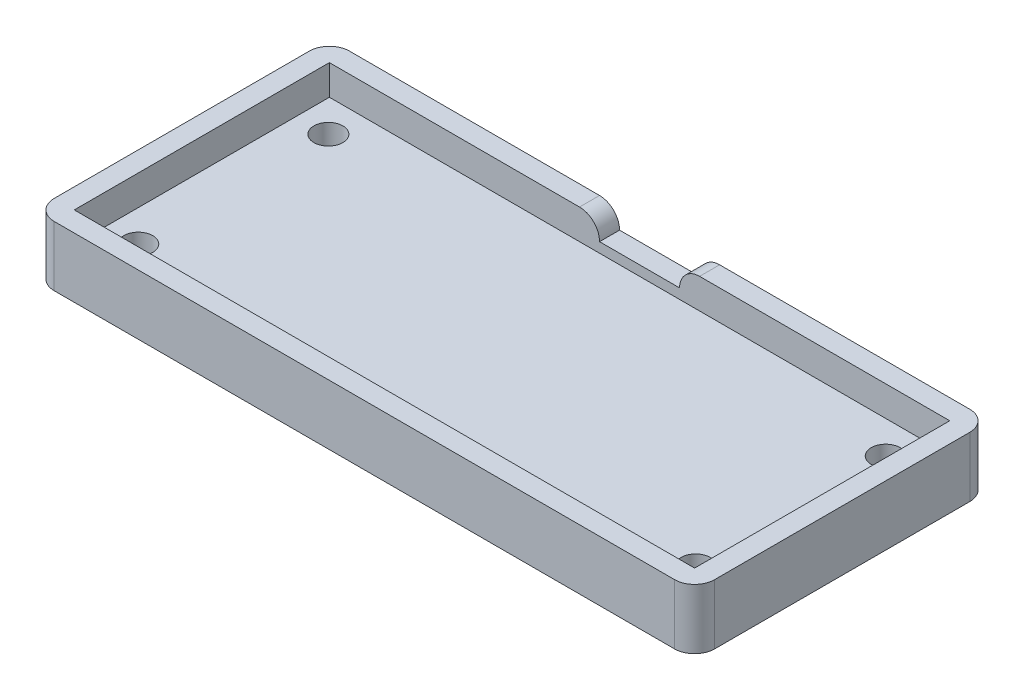
ISO-10303-21;
HEADER;
FILE_DESCRIPTION(('STEP AP214'),'2;1');
FILE_NAME('part.step','',(''),(''),'','','');
FILE_SCHEMA(('AUTOMOTIVE_DESIGN { 1 0 10303 214 1 1 1 1 }'));
ENDSEC;
DATA;
#1=APPLICATION_CONTEXT('core data for automotive mechanical design processes');
#2=APPLICATION_PROTOCOL_DEFINITION('international standard','automotive_design',2000,#1);
#3=PRODUCT_CONTEXT('',#1,'mechanical');
#4=PRODUCT('Part','Part','',(#3));
#5=PRODUCT_RELATED_PRODUCT_CATEGORY('part','',(#4));
#6=PRODUCT_DEFINITION_FORMATION('','',#4);
#7=PRODUCT_DEFINITION_CONTEXT('part definition',#1,'design');
#8=PRODUCT_DEFINITION('design','',#6,#7);
#9=PRODUCT_DEFINITION_SHAPE('','',#8);
#10=(LENGTH_UNIT() NAMED_UNIT(*) SI_UNIT(.MILLI.,.METRE.));
#11=(NAMED_UNIT(*) PLANE_ANGLE_UNIT() SI_UNIT($,.RADIAN.));
#12=(NAMED_UNIT(*) SI_UNIT($,.STERADIAN.) SOLID_ANGLE_UNIT());
#13=UNCERTAINTY_MEASURE_WITH_UNIT(LENGTH_MEASURE(1.E-05),#10,'distance_accuracy_value','');
#14=(GEOMETRIC_REPRESENTATION_CONTEXT(3) GLOBAL_UNCERTAINTY_ASSIGNED_CONTEXT((#13)) GLOBAL_UNIT_ASSIGNED_CONTEXT((#10,
#11,#12)) REPRESENTATION_CONTEXT('',''));
#15=CARTESIAN_POINT('',(0.,0.,0.));
#16=DIRECTION('',(0.,0.,1.));
#17=DIRECTION('',(1.,0.,0.));
#18=AXIS2_PLACEMENT_3D('',#15,#16,#17);
#19=CARTESIAN_POINT('',(-5.15,3.,0.));
#20=DIRECTION('',(-1.,0.,0.));
#21=DIRECTION('',(0.,0.,1.));
#22=AXIS2_PLACEMENT_3D('',#19,#20,#21);
#23=PLANE('',#22);
#24=DIRECTION('',(0.,0.,-1.));
#25=VECTOR('',#24,1.);
#26=CARTESIAN_POINT('',(-5.15,6.,0.));
#27=LINE('',#26,#25);
#28=CARTESIAN_POINT('',(-5.15,6.,3.25));
#29=VERTEX_POINT('',#28);
#30=CARTESIAN_POINT('',(-5.15,6.,-22.25));
#31=VERTEX_POINT('',#30);
#32=EDGE_CURVE('E180',#29,#31,#27,.T.);
#33=ORIENTED_EDGE('',*,*,#32,.T.);
#34=DIRECTION('',(0.,-1.,0.));
#35=VECTOR('',#34,1.);
#36=CARTESIAN_POINT('',(-5.15,3.,-22.25));
#37=LINE('',#36,#35);
#38=CARTESIAN_POINT('',(-5.15,0.,-22.25));
#39=VERTEX_POINT('',#38);
#40=EDGE_CURVE('E293',#31,#39,#37,.T.);
#41=ORIENTED_EDGE('',*,*,#40,.T.);
#42=DIRECTION('',(0.,0.,-1.));
#43=VECTOR('',#42,1.);
#44=CARTESIAN_POINT('',(-5.15,0.,0.));
#45=LINE('',#44,#43);
#46=CARTESIAN_POINT('',(-5.15,0.,3.25));
#47=VERTEX_POINT('',#46);
#48=EDGE_CURVE('E276',#47,#39,#45,.T.);
#49=ORIENTED_EDGE('',*,*,#48,.F.);
#50=DIRECTION('',(0.,-1.,0.));
#51=VECTOR('',#50,1.);
#52=CARTESIAN_POINT('',(-5.15,6.,3.25));
#53=LINE('',#52,#51);
#54=EDGE_CURVE('E260',#47,#29,#53,.F.);
#55=ORIENTED_EDGE('',*,*,#54,.T.);
#56=EDGE_LOOP('',(#33,#41,#49,#55));
#57=FACE_BOUND('',#56,.T.);
#58=ADVANCED_FACE('F41',(#57),#23,.T.);
#59=CARTESIAN_POINT('',(0.,3.,5.25));
#60=DIRECTION('',(0.,0.,-1.));
#61=DIRECTION('',(-1.,0.,0.));
#62=AXIS2_PLACEMENT_3D('',#59,#60,#61);
#63=PLANE('',#62);
#64=DIRECTION('',(1.,0.,0.));
#65=VECTOR('',#64,1.);
#66=CARTESIAN_POINT('',(0.,0.,5.25));
#67=LINE('',#66,#65);
#68=CARTESIAN_POINT('',(-3.15,0.,5.25));
#69=VERTEX_POINT('',#68);
#70=CARTESIAN_POINT('',(58.85,0.,5.25));
#71=VERTEX_POINT('',#70);
#72=EDGE_CURVE('E280',#69,#71,#67,.T.);
#73=ORIENTED_EDGE('',*,*,#72,.T.);
#74=DIRECTION('',(0.,-1.,0.));
#75=VECTOR('',#74,1.);
#76=CARTESIAN_POINT('',(58.85,3.,5.25));
#77=LINE('',#76,#75);
#78=CARTESIAN_POINT('',(58.85,6.,5.25));
#79=VERTEX_POINT('',#78);
#80=EDGE_CURVE('E340',#71,#79,#77,.F.);
#81=ORIENTED_EDGE('',*,*,#80,.T.);
#82=DIRECTION('',(1.,0.,0.));
#83=VECTOR('',#82,1.);
#84=CARTESIAN_POINT('',(0.,6.,5.25));
#85=LINE('',#84,#83);
#86=CARTESIAN_POINT('',(-3.15,6.,5.25));
#87=VERTEX_POINT('',#86);
#88=EDGE_CURVE('E184',#87,#79,#85,.T.);
#89=ORIENTED_EDGE('',*,*,#88,.F.);
#90=DIRECTION('',(0.,-1.,0.));
#91=VECTOR('',#90,1.);
#92=CARTESIAN_POINT('',(-3.15,0.,5.25));
#93=LINE('',#92,#91);
#94=EDGE_CURVE('E336',#87,#69,#93,.T.);
#95=ORIENTED_EDGE('',*,*,#94,.T.);
#96=EDGE_LOOP('',(#73,#81,#89,#95));
#97=FACE_BOUND('',#96,.T.);
#98=ADVANCED_FACE('F376',(#97),#63,.F.);
#99=CARTESIAN_POINT('',(60.85,3.,0.));
#100=DIRECTION('',(-1.,0.,0.));
#101=DIRECTION('',(0.,0.,1.));
#102=AXIS2_PLACEMENT_3D('',#99,#100,#101);
#103=PLANE('',#102);
#104=DIRECTION('',(0.,0.,-1.));
#105=VECTOR('',#104,1.);
#106=CARTESIAN_POINT('',(60.85,0.,0.));
#107=LINE('',#106,#105);
#108=CARTESIAN_POINT('',(60.85,0.,3.25));
#109=VERTEX_POINT('',#108);
#110=CARTESIAN_POINT('',(60.85,0.,-22.25));
#111=VERTEX_POINT('',#110);
#112=EDGE_CURVE('E284',#109,#111,#107,.T.);
#113=ORIENTED_EDGE('',*,*,#112,.T.);
#114=DIRECTION('',(0.,-1.,0.));
#115=VECTOR('',#114,1.);
#116=CARTESIAN_POINT('',(60.85,6.,-22.25));
#117=LINE('',#116,#115);
#118=CARTESIAN_POINT('',(60.85,6.,-22.25));
#119=VERTEX_POINT('',#118);
#120=EDGE_CURVE('E333',#111,#119,#117,.F.);
#121=ORIENTED_EDGE('',*,*,#120,.T.);
#122=DIRECTION('',(0.,0.,-1.));
#123=VECTOR('',#122,1.);
#124=CARTESIAN_POINT('',(60.85,6.,0.));
#125=LINE('',#124,#123);
#126=CARTESIAN_POINT('',(60.85,6.,3.25));
#127=VERTEX_POINT('',#126);
#128=EDGE_CURVE('E188',#127,#119,#125,.T.);
#129=ORIENTED_EDGE('',*,*,#128,.F.);
#130=DIRECTION('',(0.,-1.,0.));
#131=VECTOR('',#130,1.);
#132=CARTESIAN_POINT('',(60.85,3.,3.25));
#133=LINE('',#132,#131);
#134=EDGE_CURVE('E329',#127,#109,#133,.T.);
#135=ORIENTED_EDGE('',*,*,#134,.T.);
#136=EDGE_LOOP('',(#113,#121,#129,#135));
#137=FACE_BOUND('',#136,.T.);
#138=ADVANCED_FACE('F368',(#137),#103,.F.);
#139=CARTESIAN_POINT('',(0.,3.,0.));
#140=DIRECTION('',(0.,-1.,0.));
#141=DIRECTION('',(0.,0.,-1.));
#142=AXIS2_PLACEMENT_3D('',#139,#140,#141);
#143=CYLINDRICAL_SURFACE('',#142,1.45);
#144=CARTESIAN_POINT('',(0.,3.,0.));
#145=DIRECTION('',(0.,1.,0.));
#146=DIRECTION('',(0.,0.,1.));
#147=AXIS2_PLACEMENT_3D('',#144,#145,#146);
#148=CIRCLE('',#147,1.45);
#149=CARTESIAN_POINT('',(0.,3.,1.45));
#150=VERTEX_POINT('',#149);
#151=EDGE_CURVE('E256',#150,#150,#148,.F.);
#152=ORIENTED_EDGE('',*,*,#151,.F.);
#153=EDGE_LOOP('',(#152));
#154=FACE_BOUND('',#153,.T.);
#155=CARTESIAN_POINT('',(0.,0.,0.));
#156=DIRECTION('',(0.,1.,0.));
#157=DIRECTION('',(0.,0.,1.));
#158=AXIS2_PLACEMENT_3D('',#155,#156,#157);
#159=CIRCLE('',#158,1.45);
#160=CARTESIAN_POINT('',(0.,0.,1.45));
#161=VERTEX_POINT('',#160);
#162=EDGE_CURVE('E272',#161,#161,#159,.F.);
#163=ORIENTED_EDGE('',*,*,#162,.T.);
#164=EDGE_LOOP('',(#163));
#165=FACE_BOUND('',#164,.T.);
#166=ADVANCED_FACE('F426',(#154,#165),#143,.F.);
#167=CARTESIAN_POINT('',(55.7,3.,0.));
#168=DIRECTION('',(0.,-1.,0.));
#169=DIRECTION('',(0.,0.,-1.));
#170=AXIS2_PLACEMENT_3D('',#167,#168,#169);
#171=CYLINDRICAL_SURFACE('',#170,1.45);
#172=CARTESIAN_POINT('',(55.7,3.,0.));
#173=DIRECTION('',(0.,1.,0.));
#174=DIRECTION('',(0.,0.,1.));
#175=AXIS2_PLACEMENT_3D('',#172,#173,#174);
#176=CIRCLE('',#175,1.45);
#177=CARTESIAN_POINT('',(55.7,3.,1.45));
#178=VERTEX_POINT('',#177);
#179=EDGE_CURVE('E252',#178,#178,#176,.T.);
#180=ORIENTED_EDGE('',*,*,#179,.T.);
#181=EDGE_LOOP('',(#180));
#182=FACE_BOUND('',#181,.T.);
#183=CARTESIAN_POINT('',(55.7,0.,0.));
#184=DIRECTION('',(0.,1.,0.));
#185=DIRECTION('',(0.,0.,1.));
#186=AXIS2_PLACEMENT_3D('',#183,#184,#185);
#187=CIRCLE('',#186,1.45);
#188=CARTESIAN_POINT('',(55.7,0.,1.45));
#189=VERTEX_POINT('',#188);
#190=EDGE_CURVE('E268',#189,#189,#187,.T.);
#191=ORIENTED_EDGE('',*,*,#190,.F.);
#192=EDGE_LOOP('',(#191));
#193=FACE_BOUND('',#192,.T.);
#194=ADVANCED_FACE('F429',(#182,#193),#171,.F.);
#195=CARTESIAN_POINT('',(0.,3.,-19.));
#196=DIRECTION('',(0.,-1.,0.));
#197=DIRECTION('',(0.,0.,-1.));
#198=AXIS2_PLACEMENT_3D('',#195,#196,#197);
#199=CYLINDRICAL_SURFACE('',#198,1.45);
#200=CARTESIAN_POINT('',(0.,3.,-19.));
#201=DIRECTION('',(0.,1.,0.));
#202=DIRECTION('',(0.,0.,1.));
#203=AXIS2_PLACEMENT_3D('',#200,#201,#202);
#204=CIRCLE('',#203,1.45);
#205=CARTESIAN_POINT('',(0.,3.,-17.55));
#206=VERTEX_POINT('',#205);
#207=EDGE_CURVE('E247',#206,#206,#204,.T.);
#208=ORIENTED_EDGE('',*,*,#207,.T.);
#209=EDGE_LOOP('',(#208));
#210=FACE_BOUND('',#209,.T.);
#211=CARTESIAN_POINT('',(0.,0.,-19.));
#212=DIRECTION('',(0.,1.,0.));
#213=DIRECTION('',(0.,0.,1.));
#214=AXIS2_PLACEMENT_3D('',#211,#212,#213);
#215=CIRCLE('',#214,1.45);
#216=CARTESIAN_POINT('',(0.,0.,-17.55));
#217=VERTEX_POINT('',#216);
#218=EDGE_CURVE('E264',#217,#217,#215,.T.);
#219=ORIENTED_EDGE('',*,*,#218,.F.);
#220=EDGE_LOOP('',(#219));
#221=FACE_BOUND('',#220,.T.);
#222=ADVANCED_FACE('F433',(#210,#221),#199,.F.);
#223=CARTESIAN_POINT('',(55.7,3.,-19.));
#224=DIRECTION('',(0.,-1.,0.));
#225=DIRECTION('',(0.,0.,-1.));
#226=AXIS2_PLACEMENT_3D('',#223,#224,#225);
#227=CYLINDRICAL_SURFACE('',#226,1.45);
#228=CARTESIAN_POINT('',(55.7,3.,-19.));
#229=DIRECTION('',(0.,1.,0.));
#230=DIRECTION('',(0.,0.,1.));
#231=AXIS2_PLACEMENT_3D('',#228,#229,#230);
#232=CIRCLE('',#231,1.45);
#233=CARTESIAN_POINT('',(55.7,3.,-17.55));
#234=VERTEX_POINT('',#233);
#235=EDGE_CURVE('E243',#234,#234,#232,.F.);
#236=ORIENTED_EDGE('',*,*,#235,.F.);
#237=EDGE_LOOP('',(#236));
#238=FACE_BOUND('',#237,.T.);
#239=CARTESIAN_POINT('',(55.7,0.,-19.));
#240=DIRECTION('',(0.,1.,0.));
#241=DIRECTION('',(0.,0.,1.));
#242=AXIS2_PLACEMENT_3D('',#239,#240,#241);
#243=CIRCLE('',#242,1.45);
#244=CARTESIAN_POINT('',(55.7,0.,-17.55));
#245=VERTEX_POINT('',#244);
#246=EDGE_CURVE('E242',#245,#245,#243,.F.);
#247=ORIENTED_EDGE('',*,*,#246,.T.);
#248=EDGE_LOOP('',(#247));
#249=FACE_BOUND('',#248,.T.);
#250=ADVANCED_FACE('F437',(#238,#249),#227,.F.);
#251=CARTESIAN_POINT('',(0.,3.,-24.25));
#252=DIRECTION('',(0.,0.,-1.));
#253=DIRECTION('',(-1.,0.,0.));
#254=AXIS2_PLACEMENT_3D('',#251,#252,#253);
#255=PLANE('',#254);
#256=DIRECTION('',(-1.,0.,0.));
#257=VECTOR('',#256,1.);
#258=CARTESIAN_POINT('',(23.85,4.,-24.25));
#259=LINE('',#258,#257);
#260=CARTESIAN_POINT('',(31.85,4.,-24.25));
#261=VERTEX_POINT('',#260);
#262=CARTESIAN_POINT('',(23.85,4.,-24.25));
#263=VERTEX_POINT('',#262);
#264=EDGE_CURVE('E167',#261,#263,#259,.T.);
#265=ORIENTED_EDGE('',*,*,#264,.F.);
#266=CARTESIAN_POINT('',(33.85,4.,-24.25));
#267=DIRECTION('',(0.,0.,-1.));
#268=DIRECTION('',(-1.,0.,0.));
#269=AXIS2_PLACEMENT_3D('',#266,#267,#268);
#270=CIRCLE('',#269,2.);
#271=CARTESIAN_POINT('',(33.85,6.,-24.25));
#272=VERTEX_POINT('',#271);
#273=EDGE_CURVE('E346',#261,#272,#270,.T.);
#274=ORIENTED_EDGE('',*,*,#273,.T.);
#275=DIRECTION('',(1.,0.,0.));
#276=VECTOR('',#275,1.);
#277=CARTESIAN_POINT('',(0.,6.,-24.25));
#278=LINE('',#277,#276);
#279=CARTESIAN_POINT('',(58.85,6.,-24.25));
#280=VERTEX_POINT('',#279);
#281=EDGE_CURVE('E192',#272,#280,#278,.T.);
#282=ORIENTED_EDGE('',*,*,#281,.T.);
#283=DIRECTION('',(0.,-1.,0.));
#284=VECTOR('',#283,1.);
#285=CARTESIAN_POINT('',(58.85,0.,-24.25));
#286=LINE('',#285,#284);
#287=CARTESIAN_POINT('',(58.85,0.,-24.25));
#288=VERTEX_POINT('',#287);
#289=EDGE_CURVE('E309',#280,#288,#286,.T.);
#290=ORIENTED_EDGE('',*,*,#289,.T.);
#291=DIRECTION('',(1.,0.,0.));
#292=VECTOR('',#291,1.);
#293=CARTESIAN_POINT('',(0.,0.,-24.25));
#294=LINE('',#293,#292);
#295=CARTESIAN_POINT('',(-3.15,0.,-24.25));
#296=VERTEX_POINT('',#295);
#297=EDGE_CURVE('E248',#296,#288,#294,.T.);
#298=ORIENTED_EDGE('',*,*,#297,.F.);
#299=DIRECTION('',(0.,-1.,0.));
#300=VECTOR('',#299,1.);
#301=CARTESIAN_POINT('',(-3.15,3.,-24.25));
#302=LINE('',#301,#300);
#303=CARTESIAN_POINT('',(-3.15,6.,-24.25));
#304=VERTEX_POINT('',#303);
#305=EDGE_CURVE('E313',#296,#304,#302,.F.);
#306=ORIENTED_EDGE('',*,*,#305,.T.);
#307=CARTESIAN_POINT('',(21.85,6.,-24.25));
#308=VERTEX_POINT('',#307);
#309=EDGE_CURVE('E193',#304,#308,#278,.T.);
#310=ORIENTED_EDGE('',*,*,#309,.T.);
#311=CARTESIAN_POINT('',(21.85,4.,-24.25));
#312=DIRECTION('',(0.,0.,-1.));
#313=DIRECTION('',(-1.,0.,0.));
#314=AXIS2_PLACEMENT_3D('',#311,#312,#313);
#315=CIRCLE('',#314,2.);
#316=EDGE_CURVE('E343',#308,#263,#315,.T.);
#317=ORIENTED_EDGE('',*,*,#316,.T.);
#318=EDGE_LOOP('',(#265,#274,#282,#290,#298,#306,#310,#317));
#319=FACE_BOUND('',#318,.T.);
#320=ADVANCED_FACE('F355',(#319),#255,.T.);
#321=CARTESIAN_POINT('',(0.,3.,0.));
#322=DIRECTION('',(0.,1.,0.));
#323=DIRECTION('',(0.,0.,1.));
#324=AXIS2_PLACEMENT_3D('',#321,#322,#323);
#325=PLANE('',#324);
#326=DIRECTION('',(0.,0.,1.));
#327=VECTOR('',#326,1.);
#328=CARTESIAN_POINT('',(58.85,3.,0.));
#329=LINE('',#328,#327);
#330=CARTESIAN_POINT('',(58.85,3.,-22.25));
#331=VERTEX_POINT('',#330);
#332=CARTESIAN_POINT('',(58.85,3.,3.25000000000001));
#333=VERTEX_POINT('',#332);
#334=EDGE_CURVE('E239',#331,#333,#329,.T.);
#335=ORIENTED_EDGE('',*,*,#334,.F.);
#336=DIRECTION('',(-1.,0.,0.));
#337=VECTOR('',#336,1.);
#338=CARTESIAN_POINT('',(0.,3.,-22.25));
#339=LINE('',#338,#337);
#340=CARTESIAN_POINT('',(-3.15,3.,-22.25));
#341=VERTEX_POINT('',#340);
#342=EDGE_CURVE('E228',#331,#341,#339,.T.);
#343=ORIENTED_EDGE('',*,*,#342,.T.);
#344=DIRECTION('',(0.,0.,1.));
#345=VECTOR('',#344,1.);
#346=CARTESIAN_POINT('',(-3.15,3.,0.));
#347=LINE('',#346,#345);
#348=CARTESIAN_POINT('',(-3.15,3.,3.25));
#349=VERTEX_POINT('',#348);
#350=EDGE_CURVE('E232',#341,#349,#347,.T.);
#351=ORIENTED_EDGE('',*,*,#350,.T.);
#352=DIRECTION('',(-1.,0.,0.));
#353=VECTOR('',#352,1.);
#354=CARTESIAN_POINT('',(0.,3.,3.25));
#355=LINE('',#354,#353);
#356=EDGE_CURVE('E236',#333,#349,#355,.T.);
#357=ORIENTED_EDGE('',*,*,#356,.F.);
#358=EDGE_LOOP('',(#335,#343,#351,#357));
#359=FACE_BOUND('',#358,.T.);
#360=ORIENTED_EDGE('',*,*,#235,.T.);
#361=EDGE_LOOP('',(#360));
#362=FACE_BOUND('',#361,.T.);
#363=ORIENTED_EDGE('',*,*,#207,.F.);
#364=EDGE_LOOP('',(#363));
#365=FACE_BOUND('',#364,.T.);
#366=ORIENTED_EDGE('',*,*,#179,.F.);
#367=EDGE_LOOP('',(#366));
#368=FACE_BOUND('',#367,.T.);
#369=ORIENTED_EDGE('',*,*,#151,.T.);
#370=EDGE_LOOP('',(#369));
#371=FACE_BOUND('',#370,.T.);
#372=ADVANCED_FACE('F402',(#359,#362,#365,#368,#371),#325,.T.);
#373=CARTESIAN_POINT('',(0.,0.,0.));
#374=DIRECTION('',(0.,1.,0.));
#375=DIRECTION('',(0.,0.,1.));
#376=AXIS2_PLACEMENT_3D('',#373,#374,#375);
#377=PLANE('',#376);
#378=ORIENTED_EDGE('',*,*,#246,.F.);
#379=EDGE_LOOP('',(#378));
#380=FACE_BOUND('',#379,.T.);
#381=ORIENTED_EDGE('',*,*,#218,.T.);
#382=EDGE_LOOP('',(#381));
#383=FACE_BOUND('',#382,.T.);
#384=ORIENTED_EDGE('',*,*,#190,.T.);
#385=EDGE_LOOP('',(#384));
#386=FACE_BOUND('',#385,.T.);
#387=ORIENTED_EDGE('',*,*,#162,.F.);
#388=EDGE_LOOP('',(#387));
#389=FACE_BOUND('',#388,.T.);
#390=ORIENTED_EDGE('',*,*,#48,.T.);
#391=CARTESIAN_POINT('',(-3.15,0.,-22.25));
#392=DIRECTION('',(0.,1.,0.));
#393=DIRECTION('',(0.,0.,1.));
#394=AXIS2_PLACEMENT_3D('',#391,#392,#393);
#395=CIRCLE('',#394,2.);
#396=EDGE_CURVE('E306',#39,#296,#395,.F.);
#397=ORIENTED_EDGE('',*,*,#396,.T.);
#398=ORIENTED_EDGE('',*,*,#297,.T.);
#399=CARTESIAN_POINT('',(58.85,0.,-22.25));
#400=DIRECTION('',(0.,1.,0.));
#401=DIRECTION('',(0.,0.,1.));
#402=AXIS2_PLACEMENT_3D('',#399,#400,#401);
#403=CIRCLE('',#402,2.);
#404=EDGE_CURVE('E303',#288,#111,#403,.F.);
#405=ORIENTED_EDGE('',*,*,#404,.T.);
#406=ORIENTED_EDGE('',*,*,#112,.F.);
#407=CARTESIAN_POINT('',(58.85,0.,3.25));
#408=DIRECTION('',(0.,1.,0.));
#409=DIRECTION('',(0.,0.,1.));
#410=AXIS2_PLACEMENT_3D('',#407,#408,#409);
#411=CIRCLE('',#410,2.);
#412=EDGE_CURVE('E300',#109,#71,#411,.F.);
#413=ORIENTED_EDGE('',*,*,#412,.T.);
#414=ORIENTED_EDGE('',*,*,#72,.F.);
#415=CARTESIAN_POINT('',(-3.15,0.,3.25));
#416=DIRECTION('',(0.,1.,0.));
#417=DIRECTION('',(0.,0.,1.));
#418=AXIS2_PLACEMENT_3D('',#415,#416,#417);
#419=CIRCLE('',#418,2.);
#420=EDGE_CURVE('E297',#69,#47,#419,.F.);
#421=ORIENTED_EDGE('',*,*,#420,.T.);
#422=EDGE_LOOP('',(#390,#397,#398,#405,#406,#413,#414,#421));
#423=FACE_BOUND('',#422,.T.);
#424=ADVANCED_FACE('F366',(#380,#383,#386,#389,#423),#377,.F.);
#425=CARTESIAN_POINT('',(58.85,6.,0.));
#426=DIRECTION('',(-1.,0.,0.));
#427=DIRECTION('',(0.,0.,1.));
#428=AXIS2_PLACEMENT_3D('',#425,#426,#427);
#429=PLANE('',#428);
#430=DIRECTION('',(0.,-1.,0.));
#431=VECTOR('',#430,1.);
#432=CARTESIAN_POINT('',(58.85,6.,-22.25));
#433=LINE('',#432,#431);
#434=CARTESIAN_POINT('',(58.85,6.,-22.25));
#435=VERTEX_POINT('',#434);
#436=EDGE_CURVE('E213',#435,#331,#433,.T.);
#437=ORIENTED_EDGE('',*,*,#436,.T.);
#438=ORIENTED_EDGE('',*,*,#334,.T.);
#439=DIRECTION('',(0.,-1.,0.));
#440=VECTOR('',#439,1.);
#441=CARTESIAN_POINT('',(58.85,6.,3.25000000000001));
#442=LINE('',#441,#440);
#443=CARTESIAN_POINT('',(58.85,6.,3.25000000000001));
#444=VERTEX_POINT('',#443);
#445=EDGE_CURVE('E224',#444,#333,#442,.T.);
#446=ORIENTED_EDGE('',*,*,#445,.F.);
#447=DIRECTION('',(0.,0.,-1.));
#448=VECTOR('',#447,1.);
#449=CARTESIAN_POINT('',(58.85,6.,0.));
#450=LINE('',#449,#448);
#451=EDGE_CURVE('E197',#444,#435,#450,.T.);
#452=ORIENTED_EDGE('',*,*,#451,.T.);
#453=EDGE_LOOP('',(#437,#438,#446,#452));
#454=FACE_BOUND('',#453,.T.);
#455=ADVANCED_FACE('F405',(#454),#429,.T.);
#456=CARTESIAN_POINT('',(0.,6.,3.25));
#457=DIRECTION('',(0.,0.,-1.));
#458=DIRECTION('',(-1.,0.,0.));
#459=AXIS2_PLACEMENT_3D('',#456,#457,#458);
#460=PLANE('',#459);
#461=ORIENTED_EDGE('',*,*,#445,.T.);
#462=ORIENTED_EDGE('',*,*,#356,.T.);
#463=DIRECTION('',(0.,-1.,0.));
#464=VECTOR('',#463,1.);
#465=CARTESIAN_POINT('',(-3.15,6.,3.25));
#466=LINE('',#465,#464);
#467=CARTESIAN_POINT('',(-3.15,6.,3.25));
#468=VERTEX_POINT('',#467);
#469=EDGE_CURVE('E220',#468,#349,#466,.T.);
#470=ORIENTED_EDGE('',*,*,#469,.F.);
#471=DIRECTION('',(1.,0.,0.));
#472=VECTOR('',#471,1.);
#473=CARTESIAN_POINT('',(0.,6.,3.25));
#474=LINE('',#473,#472);
#475=EDGE_CURVE('E201',#468,#444,#474,.T.);
#476=ORIENTED_EDGE('',*,*,#475,.T.);
#477=EDGE_LOOP('',(#461,#462,#470,#476));
#478=FACE_BOUND('',#477,.T.);
#479=ADVANCED_FACE('F408',(#478),#460,.T.);
#480=CARTESIAN_POINT('',(-3.15,6.,0.));
#481=DIRECTION('',(-1.,0.,0.));
#482=DIRECTION('',(0.,0.,1.));
#483=AXIS2_PLACEMENT_3D('',#480,#481,#482);
#484=PLANE('',#483);
#485=ORIENTED_EDGE('',*,*,#350,.F.);
#486=DIRECTION('',(0.,-1.,0.));
#487=VECTOR('',#486,1.);
#488=CARTESIAN_POINT('',(-3.15,6.,-22.25));
#489=LINE('',#488,#487);
#490=CARTESIAN_POINT('',(-3.15,6.,-22.25));
#491=VERTEX_POINT('',#490);
#492=EDGE_CURVE('E217',#491,#341,#489,.T.);
#493=ORIENTED_EDGE('',*,*,#492,.F.);
#494=DIRECTION('',(0.,0.,-1.));
#495=VECTOR('',#494,1.);
#496=CARTESIAN_POINT('',(-3.15,6.,0.));
#497=LINE('',#496,#495);
#498=EDGE_CURVE('E205',#468,#491,#497,.T.);
#499=ORIENTED_EDGE('',*,*,#498,.F.);
#500=ORIENTED_EDGE('',*,*,#469,.T.);
#501=EDGE_LOOP('',(#485,#493,#499,#500));
#502=FACE_BOUND('',#501,.T.);
#503=ADVANCED_FACE('F398',(#502),#484,.F.);
#504=CARTESIAN_POINT('',(0.,6.,-22.25));
#505=DIRECTION('',(0.,0.,-1.));
#506=DIRECTION('',(-1.,0.,0.));
#507=AXIS2_PLACEMENT_3D('',#504,#505,#506);
#508=PLANE('',#507);
#509=DIRECTION('',(1.,0.,0.));
#510=VECTOR('',#509,1.);
#511=CARTESIAN_POINT('',(0.,6.,-22.25));
#512=LINE('',#511,#510);
#513=CARTESIAN_POINT('',(33.85,6.,-22.25));
#514=VERTEX_POINT('',#513);
#515=EDGE_CURVE('E209',#514,#435,#512,.T.);
#516=ORIENTED_EDGE('',*,*,#515,.F.);
#517=CARTESIAN_POINT('',(33.85,4.,-22.25));
#518=DIRECTION('',(0.,0.,-1.));
#519=DIRECTION('',(-1.,0.,0.));
#520=AXIS2_PLACEMENT_3D('',#517,#518,#519);
#521=CIRCLE('',#520,2.);
#522=CARTESIAN_POINT('',(31.85,4.,-22.25));
#523=VERTEX_POINT('',#522);
#524=EDGE_CURVE('E11',#514,#523,#521,.F.);
#525=ORIENTED_EDGE('',*,*,#524,.T.);
#526=DIRECTION('',(1.,0.,0.));
#527=VECTOR('',#526,1.);
#528=CARTESIAN_POINT('',(23.85,4.,-22.25));
#529=LINE('',#528,#527);
#530=CARTESIAN_POINT('',(23.85,4.,-22.25));
#531=VERTEX_POINT('',#530);
#532=EDGE_CURVE('E164',#531,#523,#529,.T.);
#533=ORIENTED_EDGE('',*,*,#532,.F.);
#534=CARTESIAN_POINT('',(21.85,4.,-22.25));
#535=DIRECTION('',(0.,0.,-1.));
#536=DIRECTION('',(-1.,0.,0.));
#537=AXIS2_PLACEMENT_3D('',#534,#535,#536);
#538=CIRCLE('',#537,2.);
#539=CARTESIAN_POINT('',(21.85,6.,-22.25));
#540=VERTEX_POINT('',#539);
#541=EDGE_CURVE('E50',#531,#540,#538,.F.);
#542=ORIENTED_EDGE('',*,*,#541,.T.);
#543=EDGE_CURVE('E210',#491,#540,#512,.T.);
#544=ORIENTED_EDGE('',*,*,#543,.F.);
#545=ORIENTED_EDGE('',*,*,#492,.T.);
#546=ORIENTED_EDGE('',*,*,#342,.F.);
#547=ORIENTED_EDGE('',*,*,#436,.F.);
#548=EDGE_LOOP('',(#516,#525,#533,#542,#544,#545,#546,#547));
#549=FACE_BOUND('',#548,.T.);
#550=ADVANCED_FACE('F170',(#549),#508,.F.);
#551=CARTESIAN_POINT('',(0.,6.,0.));
#552=DIRECTION('',(0.,1.,0.));
#553=DIRECTION('',(0.,0.,1.));
#554=AXIS2_PLACEMENT_3D('',#551,#552,#553);
#555=PLANE('',#554);
#556=ORIENTED_EDGE('',*,*,#281,.F.);
#557=DIRECTION('',(0.,0.,-1.));
#558=VECTOR('',#557,1.);
#559=CARTESIAN_POINT('',(33.85,6.,-22.25));
#560=LINE('',#559,#558);
#561=EDGE_CURVE('E64',#272,#514,#560,.F.);
#562=ORIENTED_EDGE('',*,*,#561,.T.);
#563=ORIENTED_EDGE('',*,*,#515,.T.);
#564=ORIENTED_EDGE('',*,*,#451,.F.);
#565=ORIENTED_EDGE('',*,*,#475,.F.);
#566=ORIENTED_EDGE('',*,*,#498,.T.);
#567=ORIENTED_EDGE('',*,*,#543,.T.);
#568=DIRECTION('',(0.,0.,1.));
#569=VECTOR('',#568,1.);
#570=CARTESIAN_POINT('',(21.85,6.,-24.25));
#571=LINE('',#570,#569);
#572=EDGE_CURVE('E157',#540,#308,#571,.F.);
#573=ORIENTED_EDGE('',*,*,#572,.T.);
#574=ORIENTED_EDGE('',*,*,#309,.F.);
#575=CARTESIAN_POINT('',(-3.15,6.,-22.25));
#576=DIRECTION('',(0.,1.,0.));
#577=DIRECTION('',(0.,0.,1.));
#578=AXIS2_PLACEMENT_3D('',#575,#576,#577);
#579=CIRCLE('',#578,2.);
#580=EDGE_CURVE('E326',#304,#31,#579,.T.);
#581=ORIENTED_EDGE('',*,*,#580,.T.);
#582=ORIENTED_EDGE('',*,*,#32,.F.);
#583=CARTESIAN_POINT('',(-3.15,6.,3.25));
#584=DIRECTION('',(0.,1.,0.));
#585=DIRECTION('',(0.,0.,1.));
#586=AXIS2_PLACEMENT_3D('',#583,#584,#585);
#587=CIRCLE('',#586,2.);
#588=EDGE_CURVE('E316',#29,#87,#587,.T.);
#589=ORIENTED_EDGE('',*,*,#588,.T.);
#590=ORIENTED_EDGE('',*,*,#88,.T.);
#591=CARTESIAN_POINT('',(58.85,6.,3.25));
#592=DIRECTION('',(0.,1.,0.));
#593=DIRECTION('',(0.,0.,1.));
#594=AXIS2_PLACEMENT_3D('',#591,#592,#593);
#595=CIRCLE('',#594,2.);
#596=EDGE_CURVE('E319',#79,#127,#595,.T.);
#597=ORIENTED_EDGE('',*,*,#596,.T.);
#598=ORIENTED_EDGE('',*,*,#128,.T.);
#599=CARTESIAN_POINT('',(58.85,6.,-22.25));
#600=DIRECTION('',(0.,1.,0.));
#601=DIRECTION('',(0.,0.,1.));
#602=AXIS2_PLACEMENT_3D('',#599,#600,#601);
#603=CIRCLE('',#602,2.);
#604=EDGE_CURVE('E322',#119,#280,#603,.T.);
#605=ORIENTED_EDGE('',*,*,#604,.T.);
#606=EDGE_LOOP('',(#556,#562,#563,#564,#565,#566,#567,#573,#574,#581,#582,#589,#590,#597,#598,#605));
#607=FACE_BOUND('',#606,.T.);
#608=ADVANCED_FACE('F359',(#607),#555,.T.);
#609=CARTESIAN_POINT('',(-3.15,3.,-22.25));
#610=DIRECTION('',(0.,-1.,0.));
#611=DIRECTION('',(0.,0.,-1.));
#612=AXIS2_PLACEMENT_3D('',#609,#610,#611);
#613=CYLINDRICAL_SURFACE('',#612,2.);
#614=ORIENTED_EDGE('',*,*,#580,.F.);
#615=ORIENTED_EDGE('',*,*,#305,.F.);
#616=ORIENTED_EDGE('',*,*,#396,.F.);
#617=ORIENTED_EDGE('',*,*,#40,.F.);
#618=EDGE_LOOP('',(#614,#615,#616,#617));
#619=FACE_BOUND('',#618,.T.);
#620=ADVANCED_FACE('F389',(#619),#613,.T.);
#621=CARTESIAN_POINT('',(58.85,3.,-22.25));
#622=DIRECTION('',(0.,1.,0.));
#623=DIRECTION('',(0.,0.,1.));
#624=AXIS2_PLACEMENT_3D('',#621,#622,#623);
#625=CYLINDRICAL_SURFACE('',#624,2.);
#626=ORIENTED_EDGE('',*,*,#604,.F.);
#627=ORIENTED_EDGE('',*,*,#120,.F.);
#628=ORIENTED_EDGE('',*,*,#404,.F.);
#629=ORIENTED_EDGE('',*,*,#289,.F.);
#630=EDGE_LOOP('',(#626,#627,#628,#629));
#631=FACE_BOUND('',#630,.T.);
#632=ADVANCED_FACE('F363',(#631),#625,.T.);
#633=CARTESIAN_POINT('',(58.85,3.,3.25));
#634=DIRECTION('',(0.,-1.,0.));
#635=DIRECTION('',(0.,0.,-1.));
#636=AXIS2_PLACEMENT_3D('',#633,#634,#635);
#637=CYLINDRICAL_SURFACE('',#636,2.);
#638=ORIENTED_EDGE('',*,*,#596,.F.);
#639=ORIENTED_EDGE('',*,*,#80,.F.);
#640=ORIENTED_EDGE('',*,*,#412,.F.);
#641=ORIENTED_EDGE('',*,*,#134,.F.);
#642=EDGE_LOOP('',(#638,#639,#640,#641));
#643=FACE_BOUND('',#642,.T.);
#644=ADVANCED_FACE('F372',(#643),#637,.T.);
#645=CARTESIAN_POINT('',(-3.15,3.,3.25));
#646=DIRECTION('',(0.,1.,0.));
#647=DIRECTION('',(0.,0.,1.));
#648=AXIS2_PLACEMENT_3D('',#645,#646,#647);
#649=CYLINDRICAL_SURFACE('',#648,2.);
#650=ORIENTED_EDGE('',*,*,#588,.F.);
#651=ORIENTED_EDGE('',*,*,#54,.F.);
#652=ORIENTED_EDGE('',*,*,#420,.F.);
#653=ORIENTED_EDGE('',*,*,#94,.F.);
#654=EDGE_LOOP('',(#650,#651,#652,#653));
#655=FACE_BOUND('',#654,.T.);
#656=ADVANCED_FACE('F381',(#655),#649,.T.);
#657=CARTESIAN_POINT('',(0.,4.,0.));
#658=DIRECTION('',(0.,1.,0.));
#659=DIRECTION('',(0.,0.,1.));
#660=AXIS2_PLACEMENT_3D('',#657,#658,#659);
#661=PLANE('',#660);
#662=DIRECTION('',(0.,0.,1.));
#663=VECTOR('',#662,1.);
#664=CARTESIAN_POINT('',(23.85,4.,-24.25));
#665=LINE('',#664,#663);
#666=EDGE_CURVE('E156',#263,#531,#665,.T.);
#667=ORIENTED_EDGE('',*,*,#666,.T.);
#668=ORIENTED_EDGE('',*,*,#532,.T.);
#669=DIRECTION('',(0.,0.,-1.));
#670=VECTOR('',#669,1.);
#671=CARTESIAN_POINT('',(31.85,4.,-24.25));
#672=LINE('',#671,#670);
#673=EDGE_CURVE('E173',#523,#261,#672,.T.);
#674=ORIENTED_EDGE('',*,*,#673,.T.);
#675=ORIENTED_EDGE('',*,*,#264,.T.);
#676=EDGE_LOOP('',(#667,#668,#674,#675));
#677=FACE_BOUND('',#676,.T.);
#678=ADVANCED_FACE('F162',(#677),#661,.T.);
#679=CARTESIAN_POINT('',(33.85,4.,-24.25));
#680=DIRECTION('',(0.,0.,1.));
#681=DIRECTION('',(1.,0.,0.));
#682=AXIS2_PLACEMENT_3D('',#679,#680,#681);
#683=CYLINDRICAL_SURFACE('',#682,2.);
#684=ORIENTED_EDGE('',*,*,#524,.F.);
#685=ORIENTED_EDGE('',*,*,#561,.F.);
#686=ORIENTED_EDGE('',*,*,#273,.F.);
#687=ORIENTED_EDGE('',*,*,#673,.F.);
#688=EDGE_LOOP('',(#684,#685,#686,#687));
#689=FACE_BOUND('',#688,.T.);
#690=ADVANCED_FACE('F410',(#689),#683,.T.);
#691=CARTESIAN_POINT('',(21.85,4.,-24.25));
#692=DIRECTION('',(0.,0.,-1.));
#693=DIRECTION('',(-1.,0.,0.));
#694=AXIS2_PLACEMENT_3D('',#691,#692,#693);
#695=CYLINDRICAL_SURFACE('',#694,2.);
#696=ORIENTED_EDGE('',*,*,#316,.F.);
#697=ORIENTED_EDGE('',*,*,#572,.F.);
#698=ORIENTED_EDGE('',*,*,#541,.F.);
#699=ORIENTED_EDGE('',*,*,#666,.F.);
#700=EDGE_LOOP('',(#696,#697,#698,#699));
#701=FACE_BOUND('',#700,.T.);
#702=ADVANCED_FACE('F43',(#701),#695,.T.);
#703=CLOSED_SHELL('',(#58,#98,#138,#166,#194,#222,#250,#320,#372,#424,#455,#479,#503,#550,#608,
#620,#632,#644,#656,#678,#690,#702));
#704=MANIFOLD_SOLID_BREP('B2',#703);
#705=ADVANCED_BREP_SHAPE_REPRESENTATION('',(#18,#704),#14);
#706=SHAPE_DEFINITION_REPRESENTATION(#9,#705);
ENDSEC;
END-ISO-10303-21;
